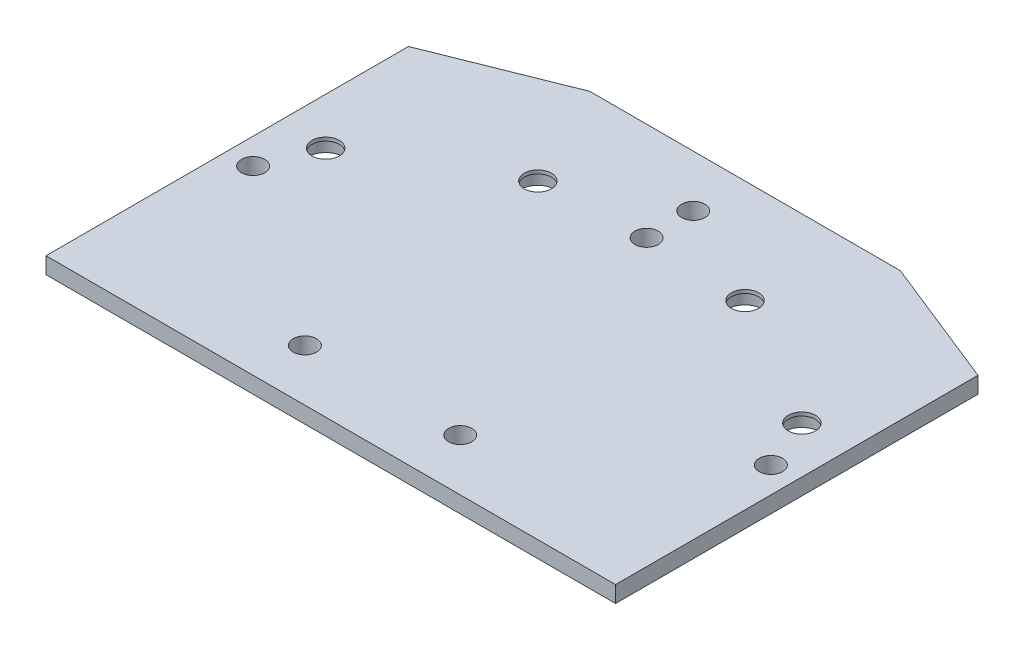
ISO-10303-21;
HEADER;
FILE_DESCRIPTION(('STEP AP214'),'2;1');
FILE_NAME('part.step','',(''),(''),'','','');
FILE_SCHEMA(('AUTOMOTIVE_DESIGN { 1 0 10303 214 1 1 1 1 }'));
ENDSEC;
DATA;
#1=APPLICATION_CONTEXT('core data for automotive mechanical design processes');
#2=APPLICATION_PROTOCOL_DEFINITION('international standard','automotive_design',2000,#1);
#3=PRODUCT_CONTEXT('',#1,'mechanical');
#4=PRODUCT('Part','Part','',(#3));
#5=PRODUCT_RELATED_PRODUCT_CATEGORY('part','',(#4));
#6=PRODUCT_DEFINITION_FORMATION('','',#4);
#7=PRODUCT_DEFINITION_CONTEXT('part definition',#1,'design');
#8=PRODUCT_DEFINITION('design','',#6,#7);
#9=PRODUCT_DEFINITION_SHAPE('','',#8);
#10=(LENGTH_UNIT() NAMED_UNIT(*) SI_UNIT(.MILLI.,.METRE.));
#11=(NAMED_UNIT(*) PLANE_ANGLE_UNIT() SI_UNIT($,.RADIAN.));
#12=(NAMED_UNIT(*) SI_UNIT($,.STERADIAN.) SOLID_ANGLE_UNIT());
#13=UNCERTAINTY_MEASURE_WITH_UNIT(LENGTH_MEASURE(1.E-05),#10,'distance_accuracy_value','');
#14=(GEOMETRIC_REPRESENTATION_CONTEXT(3) GLOBAL_UNCERTAINTY_ASSIGNED_CONTEXT((#13)) GLOBAL_UNIT_ASSIGNED_CONTEXT((#10,
#11,#12)) REPRESENTATION_CONTEXT('',''));
#15=CARTESIAN_POINT('',(0.,0.,0.));
#16=DIRECTION('',(0.,0.,1.));
#17=DIRECTION('',(1.,0.,0.));
#18=AXIS2_PLACEMENT_3D('',#15,#16,#17);
#19=CARTESIAN_POINT('',(-45.9807621135332,1.5875,9.99999999999996));
#20=DIRECTION('',(0.,1.,0.));
#21=DIRECTION('',(0.,0.,1.));
#22=AXIS2_PLACEMENT_3D('',#19,#20,#21);
#23=CYLINDRICAL_SURFACE('',#22,2.625);
#24=CARTESIAN_POINT('',(-45.9807621135332,1.5875,9.99999999999996));
#25=DIRECTION('',(0.,1.,0.));
#26=DIRECTION('',(0.,0.,1.));
#27=AXIS2_PLACEMENT_3D('',#24,#25,#26);
#28=CIRCLE('',#27,2.625);
#29=CARTESIAN_POINT('',(-45.9807621135332,1.5875,12.625));
#30=VERTEX_POINT('',#29);
#31=EDGE_CURVE('E147',#30,#30,#28,.T.);
#32=ORIENTED_EDGE('',*,*,#31,.T.);
#33=EDGE_LOOP('',(#32));
#34=FACE_BOUND('',#33,.T.);
#35=CARTESIAN_POINT('',(-45.9807621135332,0.9125,9.99999999999996));
#36=DIRECTION('',(0.,-1.,0.));
#37=DIRECTION('',(0.,0.,-1.));
#38=AXIS2_PLACEMENT_3D('',#35,#36,#37);
#39=CIRCLE('',#38,2.625);
#40=CARTESIAN_POINT('',(-45.9807621135332,0.9125,7.37499999999996));
#41=VERTEX_POINT('',#40);
#42=EDGE_CURVE('E54',#41,#41,#39,.F.);
#43=ORIENTED_EDGE('',*,*,#42,.F.);
#44=EDGE_LOOP('',(#43));
#45=FACE_BOUND('',#44,.T.);
#46=ADVANCED_FACE('F50',(#34,#45),#23,.F.);
#47=CARTESIAN_POINT('',(-20.,1.5875,-4.99999999999997));
#48=DIRECTION('',(0.,1.,0.));
#49=DIRECTION('',(0.,0.,1.));
#50=AXIS2_PLACEMENT_3D('',#47,#48,#49);
#51=CYLINDRICAL_SURFACE('',#50,2.625);
#52=CARTESIAN_POINT('',(-20.,1.5875,-4.99999999999997));
#53=DIRECTION('',(0.,1.,0.));
#54=DIRECTION('',(0.,0.,1.));
#55=AXIS2_PLACEMENT_3D('',#52,#53,#54);
#56=CIRCLE('',#55,2.625);
#57=CARTESIAN_POINT('',(-20.,1.5875,-2.37499999999997));
#58=VERTEX_POINT('',#57);
#59=EDGE_CURVE('E200',#58,#58,#56,.T.);
#60=ORIENTED_EDGE('',*,*,#59,.T.);
#61=EDGE_LOOP('',(#60));
#62=FACE_BOUND('',#61,.T.);
#63=CARTESIAN_POINT('',(-20.,0.9125,-4.99999999999997));
#64=DIRECTION('',(0.,-1.,0.));
#65=DIRECTION('',(0.,0.,-1.));
#66=AXIS2_PLACEMENT_3D('',#63,#64,#65);
#67=CIRCLE('',#66,2.625);
#68=CARTESIAN_POINT('',(-20.,0.9125,-7.62499999999997));
#69=VERTEX_POINT('',#68);
#70=EDGE_CURVE('E182',#69,#69,#67,.F.);
#71=ORIENTED_EDGE('',*,*,#70,.F.);
#72=EDGE_LOOP('',(#71));
#73=FACE_BOUND('',#72,.T.);
#74=ADVANCED_FACE('F230',(#62,#73),#51,.F.);
#75=CARTESIAN_POINT('',(45.9807621135332,1.5875,9.99999999999996));
#76=DIRECTION('',(0.,1.,0.));
#77=DIRECTION('',(0.,0.,1.));
#78=AXIS2_PLACEMENT_3D('',#75,#76,#77);
#79=CYLINDRICAL_SURFACE('',#78,2.625);
#80=CARTESIAN_POINT('',(45.9807621135332,1.5875,9.99999999999996));
#81=DIRECTION('',(0.,1.,0.));
#82=DIRECTION('',(0.,0.,1.));
#83=AXIS2_PLACEMENT_3D('',#80,#81,#82);
#84=CIRCLE('',#83,2.625);
#85=CARTESIAN_POINT('',(45.9807621135332,1.5875,12.625));
#86=VERTEX_POINT('',#85);
#87=EDGE_CURVE('E194',#86,#86,#84,.T.);
#88=ORIENTED_EDGE('',*,*,#87,.T.);
#89=EDGE_LOOP('',(#88));
#90=FACE_BOUND('',#89,.T.);
#91=CARTESIAN_POINT('',(45.9807621135332,0.9125,9.99999999999996));
#92=DIRECTION('',(0.,-1.,0.));
#93=DIRECTION('',(0.,0.,-1.));
#94=AXIS2_PLACEMENT_3D('',#91,#92,#93);
#95=CIRCLE('',#94,2.625);
#96=CARTESIAN_POINT('',(45.9807621135332,0.9125,7.37499999999996));
#97=VERTEX_POINT('',#96);
#98=EDGE_CURVE('E178',#97,#97,#95,.F.);
#99=ORIENTED_EDGE('',*,*,#98,.F.);
#100=EDGE_LOOP('',(#99));
#101=FACE_BOUND('',#100,.T.);
#102=ADVANCED_FACE('F236',(#90,#101),#79,.F.);
#103=CARTESIAN_POINT('',(20.,1.5875,-4.99999999999997));
#104=DIRECTION('',(0.,1.,0.));
#105=DIRECTION('',(0.,0.,1.));
#106=AXIS2_PLACEMENT_3D('',#103,#104,#105);
#107=CYLINDRICAL_SURFACE('',#106,2.625);
#108=CARTESIAN_POINT('',(20.,1.5875,-4.99999999999997));
#109=DIRECTION('',(0.,1.,0.));
#110=DIRECTION('',(0.,0.,1.));
#111=AXIS2_PLACEMENT_3D('',#108,#109,#110);
#112=CIRCLE('',#111,2.625);
#113=CARTESIAN_POINT('',(20.,1.5875,-2.37499999999997));
#114=VERTEX_POINT('',#113);
#115=EDGE_CURVE('E189',#114,#114,#112,.T.);
#116=ORIENTED_EDGE('',*,*,#115,.T.);
#117=EDGE_LOOP('',(#116));
#118=FACE_BOUND('',#117,.T.);
#119=CARTESIAN_POINT('',(20.,0.9125,-4.99999999999997));
#120=DIRECTION('',(0.,-1.,0.));
#121=DIRECTION('',(0.,0.,-1.));
#122=AXIS2_PLACEMENT_3D('',#119,#120,#121);
#123=CIRCLE('',#122,2.625);
#124=CARTESIAN_POINT('',(20.,0.9125,-7.62499999999997));
#125=VERTEX_POINT('',#124);
#126=EDGE_CURVE('E174',#125,#125,#123,.F.);
#127=ORIENTED_EDGE('',*,*,#126,.F.);
#128=EDGE_LOOP('',(#127));
#129=FACE_BOUND('',#128,.T.);
#130=ADVANCED_FACE('F227',(#118,#129),#107,.F.);
#131=CARTESIAN_POINT('',(-55.,1.5875,55.));
#132=DIRECTION('',(-1.,0.,0.));
#133=DIRECTION('',(0.,0.,1.));
#134=AXIS2_PLACEMENT_3D('',#131,#132,#133);
#135=PLANE('',#134);
#136=DIRECTION('',(0.,0.,-1.));
#137=VECTOR('',#136,1.);
#138=CARTESIAN_POINT('',(-55.,-1.5875,55.));
#139=LINE('',#138,#137);
#140=CARTESIAN_POINT('',(-55.,-1.5875,55.));
#141=VERTEX_POINT('',#140);
#142=CARTESIAN_POINT('',(-55.,-1.5875,-15.));
#143=VERTEX_POINT('',#142);
#144=EDGE_CURVE('E142',#141,#143,#139,.T.);
#145=ORIENTED_EDGE('',*,*,#144,.F.);
#146=DIRECTION('',(0.,-1.,0.));
#147=VECTOR('',#146,1.);
#148=CARTESIAN_POINT('',(-55.,1.5875,55.));
#149=LINE('',#148,#147);
#150=CARTESIAN_POINT('',(-55.,1.5875,55.));
#151=VERTEX_POINT('',#150);
#152=EDGE_CURVE('E11',#151,#141,#149,.T.);
#153=ORIENTED_EDGE('',*,*,#152,.F.);
#154=DIRECTION('',(0.,0.,-1.));
#155=VECTOR('',#154,1.);
#156=CARTESIAN_POINT('',(-55.,1.5875,55.));
#157=LINE('',#156,#155);
#158=CARTESIAN_POINT('',(-55.,1.5875,-15.));
#159=VERTEX_POINT('',#158);
#160=EDGE_CURVE('E163',#151,#159,#157,.T.);
#161=ORIENTED_EDGE('',*,*,#160,.T.);
#162=DIRECTION('',(0.,-1.,0.));
#163=VECTOR('',#162,1.);
#164=CARTESIAN_POINT('',(-55.,1.5875,-15.));
#165=LINE('',#164,#163);
#166=EDGE_CURVE('E102',#159,#143,#165,.T.);
#167=ORIENTED_EDGE('',*,*,#166,.T.);
#168=EDGE_LOOP('',(#145,#153,#161,#167));
#169=FACE_BOUND('',#168,.T.);
#170=ADVANCED_FACE('F52',(#169),#135,.T.);
#171=CARTESIAN_POINT('',(55.,1.5875,55.));
#172=DIRECTION('',(0.,0.,1.));
#173=DIRECTION('',(1.,0.,0.));
#174=AXIS2_PLACEMENT_3D('',#171,#172,#173);
#175=PLANE('',#174);
#176=DIRECTION('',(-1.,0.,0.));
#177=VECTOR('',#176,1.);
#178=CARTESIAN_POINT('',(55.,-1.5875,55.));
#179=LINE('',#178,#177);
#180=CARTESIAN_POINT('',(55.,-1.5875,55.));
#181=VERTEX_POINT('',#180);
#182=EDGE_CURVE('E160',#181,#141,#179,.T.);
#183=ORIENTED_EDGE('',*,*,#182,.F.);
#184=DIRECTION('',(0.,-1.,0.));
#185=VECTOR('',#184,1.);
#186=CARTESIAN_POINT('',(55.,1.5875,55.));
#187=LINE('',#186,#185);
#188=CARTESIAN_POINT('',(55.,1.5875,55.));
#189=VERTEX_POINT('',#188);
#190=EDGE_CURVE('E61',#189,#181,#187,.T.);
#191=ORIENTED_EDGE('',*,*,#190,.F.);
#192=DIRECTION('',(-1.,0.,0.));
#193=VECTOR('',#192,1.);
#194=CARTESIAN_POINT('',(55.,1.5875,55.));
#195=LINE('',#194,#193);
#196=EDGE_CURVE('E118',#189,#151,#195,.T.);
#197=ORIENTED_EDGE('',*,*,#196,.T.);
#198=ORIENTED_EDGE('',*,*,#152,.T.);
#199=EDGE_LOOP('',(#183,#191,#197,#198));
#200=FACE_BOUND('',#199,.T.);
#201=ADVANCED_FACE('F219',(#200),#175,.T.);
#202=CARTESIAN_POINT('',(55.,1.5875,55.));
#203=DIRECTION('',(-1.,0.,0.));
#204=DIRECTION('',(0.,0.,1.));
#205=AXIS2_PLACEMENT_3D('',#202,#203,#204);
#206=PLANE('',#205);
#207=DIRECTION('',(0.,0.,-1.));
#208=VECTOR('',#207,1.);
#209=CARTESIAN_POINT('',(55.,-1.5875,55.));
#210=LINE('',#209,#208);
#211=CARTESIAN_POINT('',(55.,-1.5875,-15.));
#212=VERTEX_POINT('',#211);
#213=EDGE_CURVE('E123',#181,#212,#210,.T.);
#214=ORIENTED_EDGE('',*,*,#213,.T.);
#215=DIRECTION('',(0.,-1.,0.));
#216=VECTOR('',#215,1.);
#217=CARTESIAN_POINT('',(55.,1.5875,-15.));
#218=LINE('',#217,#216);
#219=CARTESIAN_POINT('',(55.,1.5875,-15.));
#220=VERTEX_POINT('',#219);
#221=EDGE_CURVE('E121',#220,#212,#218,.T.);
#222=ORIENTED_EDGE('',*,*,#221,.F.);
#223=DIRECTION('',(0.,0.,-1.));
#224=VECTOR('',#223,1.);
#225=CARTESIAN_POINT('',(55.,1.5875,55.));
#226=LINE('',#225,#224);
#227=EDGE_CURVE('E113',#189,#220,#226,.T.);
#228=ORIENTED_EDGE('',*,*,#227,.F.);
#229=ORIENTED_EDGE('',*,*,#190,.T.);
#230=EDGE_LOOP('',(#214,#222,#228,#229));
#231=FACE_BOUND('',#230,.T.);
#232=ADVANCED_FACE('F122',(#231),#206,.F.);
#233=CARTESIAN_POINT('',(30.,1.5875,-25.));
#234=DIRECTION('',(0.371390676354104,0.,-0.928476690885259));
#235=DIRECTION('',(-0.928476690885259,0.,-0.371390676354104));
#236=AXIS2_PLACEMENT_3D('',#233,#234,#235);
#237=PLANE('',#236);
#238=DIRECTION('',(0.928476690885259,0.,0.371390676354104));
#239=VECTOR('',#238,1.);
#240=CARTESIAN_POINT('',(30.,-1.5875,-25.));
#241=LINE('',#240,#239);
#242=CARTESIAN_POINT('',(30.,-1.5875,-25.));
#243=VERTEX_POINT('',#242);
#244=EDGE_CURVE('E155',#243,#212,#241,.T.);
#245=ORIENTED_EDGE('',*,*,#244,.F.);
#246=DIRECTION('',(0.,-1.,0.));
#247=VECTOR('',#246,1.);
#248=CARTESIAN_POINT('',(30.,1.5875,-25.));
#249=LINE('',#248,#247);
#250=CARTESIAN_POINT('',(30.,1.5875,-25.));
#251=VERTEX_POINT('',#250);
#252=EDGE_CURVE('E128',#251,#243,#249,.T.);
#253=ORIENTED_EDGE('',*,*,#252,.F.);
#254=DIRECTION('',(0.928476690885259,0.,0.371390676354104));
#255=VECTOR('',#254,1.);
#256=CARTESIAN_POINT('',(30.,1.5875,-25.));
#257=LINE('',#256,#255);
#258=EDGE_CURVE('E117',#251,#220,#257,.T.);
#259=ORIENTED_EDGE('',*,*,#258,.T.);
#260=ORIENTED_EDGE('',*,*,#221,.T.);
#261=EDGE_LOOP('',(#245,#253,#259,#260));
#262=FACE_BOUND('',#261,.T.);
#263=ADVANCED_FACE('F130',(#262),#237,.T.);
#264=CARTESIAN_POINT('',(30.,1.5875,-25.));
#265=DIRECTION('',(0.,0.,1.));
#266=DIRECTION('',(1.,0.,0.));
#267=AXIS2_PLACEMENT_3D('',#264,#265,#266);
#268=PLANE('',#267);
#269=DIRECTION('',(-1.,0.,0.));
#270=VECTOR('',#269,1.);
#271=CARTESIAN_POINT('',(30.,-1.5875,-25.));
#272=LINE('',#271,#270);
#273=CARTESIAN_POINT('',(-30.,-1.5875,-25.));
#274=VERTEX_POINT('',#273);
#275=EDGE_CURVE('E151',#243,#274,#272,.T.);
#276=ORIENTED_EDGE('',*,*,#275,.T.);
#277=DIRECTION('',(0.,-1.,0.));
#278=VECTOR('',#277,1.);
#279=CARTESIAN_POINT('',(-30.,1.5875,-25.));
#280=LINE('',#279,#278);
#281=CARTESIAN_POINT('',(-30.,1.5875,-25.));
#282=VERTEX_POINT('',#281);
#283=EDGE_CURVE('E169',#282,#274,#280,.T.);
#284=ORIENTED_EDGE('',*,*,#283,.F.);
#285=DIRECTION('',(-1.,0.,0.));
#286=VECTOR('',#285,1.);
#287=CARTESIAN_POINT('',(30.,1.5875,-25.));
#288=LINE('',#287,#286);
#289=EDGE_CURVE('E133',#251,#282,#288,.T.);
#290=ORIENTED_EDGE('',*,*,#289,.F.);
#291=ORIENTED_EDGE('',*,*,#252,.T.);
#292=EDGE_LOOP('',(#276,#284,#290,#291));
#293=FACE_BOUND('',#292,.T.);
#294=ADVANCED_FACE('F578',(#293),#268,.F.);
#295=CARTESIAN_POINT('',(-55.,1.5875,-15.));
#296=DIRECTION('',(-0.371390676354103,0.,-0.92847669088526));
#297=DIRECTION('',(-0.92847669088526,0.,0.371390676354103));
#298=AXIS2_PLACEMENT_3D('',#295,#296,#297);
#299=PLANE('',#298);
#300=DIRECTION('',(0.92847669088526,0.,-0.371390676354103));
#301=VECTOR('',#300,1.);
#302=CARTESIAN_POINT('',(-55.,-1.5875,-15.));
#303=LINE('',#302,#301);
#304=EDGE_CURVE('E146',#143,#274,#303,.T.);
#305=ORIENTED_EDGE('',*,*,#304,.F.);
#306=ORIENTED_EDGE('',*,*,#166,.F.);
#307=DIRECTION('',(0.92847669088526,0.,-0.371390676354103));
#308=VECTOR('',#307,1.);
#309=CARTESIAN_POINT('',(-55.,1.5875,-15.));
#310=LINE('',#309,#308);
#311=EDGE_CURVE('E136',#159,#282,#310,.T.);
#312=ORIENTED_EDGE('',*,*,#311,.T.);
#313=ORIENTED_EDGE('',*,*,#283,.T.);
#314=EDGE_LOOP('',(#305,#306,#312,#313));
#315=FACE_BOUND('',#314,.T.);
#316=ADVANCED_FACE('F214',(#315),#299,.T.);
#317=CARTESIAN_POINT('',(0.,1.5875,0.));
#318=DIRECTION('',(0.,1.,0.));
#319=DIRECTION('',(0.,0.,1.));
#320=AXIS2_PLACEMENT_3D('',#317,#318,#319);
#321=PLANE('',#320);
#322=CARTESIAN_POINT('',(-50.,1.5875,20.));
#323=DIRECTION('',(0.,1.,0.));
#324=DIRECTION('',(0.,0.,1.));
#325=AXIS2_PLACEMENT_3D('',#322,#323,#324);
#326=CIRCLE('',#325,2.24999999999999);
#327=CARTESIAN_POINT('',(-50.,1.5875,22.25));
#328=VERTEX_POINT('',#327);
#329=EDGE_CURVE('E347',#328,#328,#326,.T.);
#330=ORIENTED_EDGE('',*,*,#329,.F.);
#331=EDGE_LOOP('',(#330));
#332=FACE_BOUND('',#331,.T.);
#333=CARTESIAN_POINT('',(50.,1.5875,20.));
#334=DIRECTION('',(0.,1.,0.));
#335=DIRECTION('',(0.,0.,1.));
#336=AXIS2_PLACEMENT_3D('',#333,#334,#335);
#337=CIRCLE('',#336,2.24999999999999);
#338=CARTESIAN_POINT('',(50.,1.5875,22.25));
#339=VERTEX_POINT('',#338);
#340=EDGE_CURVE('E341',#339,#339,#337,.T.);
#341=ORIENTED_EDGE('',*,*,#340,.F.);
#342=EDGE_LOOP('',(#341));
#343=FACE_BOUND('',#342,.T.);
#344=CARTESIAN_POINT('',(-15.,1.5875,45.));
#345=DIRECTION('',(0.,1.,0.));
#346=DIRECTION('',(0.,0.,1.));
#347=AXIS2_PLACEMENT_3D('',#344,#345,#346);
#348=CIRCLE('',#347,2.24999999999999);
#349=CARTESIAN_POINT('',(-15.,1.5875,47.25));
#350=VERTEX_POINT('',#349);
#351=EDGE_CURVE('E335',#350,#350,#348,.T.);
#352=ORIENTED_EDGE('',*,*,#351,.F.);
#353=EDGE_LOOP('',(#352));
#354=FACE_BOUND('',#353,.T.);
#355=CARTESIAN_POINT('',(15.,1.5875,45.));
#356=DIRECTION('',(0.,1.,0.));
#357=DIRECTION('',(0.,0.,1.));
#358=AXIS2_PLACEMENT_3D('',#355,#356,#357);
#359=CIRCLE('',#358,2.24999999999999);
#360=CARTESIAN_POINT('',(15.,1.5875,47.25));
#361=VERTEX_POINT('',#360);
#362=EDGE_CURVE('E329',#361,#361,#359,.T.);
#363=ORIENTED_EDGE('',*,*,#362,.F.);
#364=EDGE_LOOP('',(#363));
#365=FACE_BOUND('',#364,.T.);
#366=CARTESIAN_POINT('',(0.,1.5875,-15.));
#367=DIRECTION('',(0.,-1.,0.));
#368=DIRECTION('',(0.,0.,-1.));
#369=AXIS2_PLACEMENT_3D('',#366,#367,#368);
#370=CIRCLE('',#369,2.25);
#371=CARTESIAN_POINT('',(0.,1.5875,-17.25));
#372=VERTEX_POINT('',#371);
#373=EDGE_CURVE('E321',#372,#372,#370,.T.);
#374=ORIENTED_EDGE('',*,*,#373,.T.);
#375=EDGE_LOOP('',(#374));
#376=FACE_BOUND('',#375,.T.);
#377=CARTESIAN_POINT('',(0.,1.5875,-5.99999999999998));
#378=DIRECTION('',(0.,-1.,0.));
#379=DIRECTION('',(0.,0.,-1.));
#380=AXIS2_PLACEMENT_3D('',#377,#378,#379);
#381=CIRCLE('',#380,2.25);
#382=CARTESIAN_POINT('',(0.,1.5875,-8.24999999999998));
#383=VERTEX_POINT('',#382);
#384=EDGE_CURVE('E301',#383,#383,#381,.T.);
#385=ORIENTED_EDGE('',*,*,#384,.T.);
#386=EDGE_LOOP('',(#385));
#387=FACE_BOUND('',#386,.T.);
#388=ORIENTED_EDGE('',*,*,#115,.F.);
#389=EDGE_LOOP('',(#388));
#390=FACE_BOUND('',#389,.T.);
#391=ORIENTED_EDGE('',*,*,#87,.F.);
#392=EDGE_LOOP('',(#391));
#393=FACE_BOUND('',#392,.T.);
#394=ORIENTED_EDGE('',*,*,#59,.F.);
#395=EDGE_LOOP('',(#394));
#396=FACE_BOUND('',#395,.T.);
#397=ORIENTED_EDGE('',*,*,#31,.F.);
#398=EDGE_LOOP('',(#397));
#399=FACE_BOUND('',#398,.T.);
#400=ORIENTED_EDGE('',*,*,#160,.F.);
#401=ORIENTED_EDGE('',*,*,#196,.F.);
#402=ORIENTED_EDGE('',*,*,#227,.T.);
#403=ORIENTED_EDGE('',*,*,#258,.F.);
#404=ORIENTED_EDGE('',*,*,#289,.T.);
#405=ORIENTED_EDGE('',*,*,#311,.F.);
#406=EDGE_LOOP('',(#400,#401,#402,#403,#404,#405));
#407=FACE_BOUND('',#406,.T.);
#408=ADVANCED_FACE('F115',(#332,#343,#354,#365,#376,#387,#390,#393,#396,#399,#407),#321,.T.);
#409=CARTESIAN_POINT('',(0.,-1.5875,0.));
#410=DIRECTION('',(0.,1.,0.));
#411=DIRECTION('',(0.,0.,1.));
#412=AXIS2_PLACEMENT_3D('',#409,#410,#411);
#413=PLANE('',#412);
#414=CARTESIAN_POINT('',(-50.,-1.5875,20.));
#415=DIRECTION('',(0.,1.,0.));
#416=DIRECTION('',(0.,0.,1.));
#417=AXIS2_PLACEMENT_3D('',#414,#415,#416);
#418=CIRCLE('',#417,2.24999999999999);
#419=CARTESIAN_POINT('',(-50.,-1.5875,22.25));
#420=VERTEX_POINT('',#419);
#421=EDGE_CURVE('E257',#420,#420,#418,.T.);
#422=ORIENTED_EDGE('',*,*,#421,.T.);
#423=EDGE_LOOP('',(#422));
#424=FACE_BOUND('',#423,.T.);
#425=CARTESIAN_POINT('',(50.,-1.5875,20.));
#426=DIRECTION('',(0.,1.,0.));
#427=DIRECTION('',(0.,0.,1.));
#428=AXIS2_PLACEMENT_3D('',#425,#426,#427);
#429=CIRCLE('',#428,2.24999999999999);
#430=CARTESIAN_POINT('',(50.,-1.5875,22.25));
#431=VERTEX_POINT('',#430);
#432=EDGE_CURVE('E261',#431,#431,#429,.T.);
#433=ORIENTED_EDGE('',*,*,#432,.T.);
#434=EDGE_LOOP('',(#433));
#435=FACE_BOUND('',#434,.T.);
#436=CARTESIAN_POINT('',(-15.,-1.5875,45.));
#437=DIRECTION('',(0.,1.,0.));
#438=DIRECTION('',(0.,0.,1.));
#439=AXIS2_PLACEMENT_3D('',#436,#437,#438);
#440=CIRCLE('',#439,2.25);
#441=CARTESIAN_POINT('',(-15.,-1.5875,47.25));
#442=VERTEX_POINT('',#441);
#443=EDGE_CURVE('E265',#442,#442,#440,.T.);
#444=ORIENTED_EDGE('',*,*,#443,.T.);
#445=EDGE_LOOP('',(#444));
#446=FACE_BOUND('',#445,.T.);
#447=CARTESIAN_POINT('',(15.,-1.5875,45.));
#448=DIRECTION('',(0.,1.,0.));
#449=DIRECTION('',(0.,0.,1.));
#450=AXIS2_PLACEMENT_3D('',#447,#448,#449);
#451=CIRCLE('',#450,2.25);
#452=CARTESIAN_POINT('',(15.,-1.5875,47.25));
#453=VERTEX_POINT('',#452);
#454=EDGE_CURVE('E269',#453,#453,#451,.T.);
#455=ORIENTED_EDGE('',*,*,#454,.T.);
#456=EDGE_LOOP('',(#455));
#457=FACE_BOUND('',#456,.T.);
#458=CARTESIAN_POINT('',(0.,-1.5875,-15.));
#459=DIRECTION('',(0.,-1.,0.));
#460=DIRECTION('',(0.,0.,-1.));
#461=AXIS2_PLACEMENT_3D('',#458,#459,#460);
#462=CIRCLE('',#461,2.25);
#463=CARTESIAN_POINT('',(0.,-1.5875,-17.25));
#464=VERTEX_POINT('',#463);
#465=EDGE_CURVE('E273',#464,#464,#462,.T.);
#466=ORIENTED_EDGE('',*,*,#465,.F.);
#467=EDGE_LOOP('',(#466));
#468=FACE_BOUND('',#467,.T.);
#469=CARTESIAN_POINT('',(0.,-1.5875,-5.99999999999998));
#470=DIRECTION('',(0.,-1.,0.));
#471=DIRECTION('',(0.,0.,-1.));
#472=AXIS2_PLACEMENT_3D('',#469,#470,#471);
#473=CIRCLE('',#472,2.25);
#474=CARTESIAN_POINT('',(0.,-1.5875,-8.24999999999998));
#475=VERTEX_POINT('',#474);
#476=EDGE_CURVE('E277',#475,#475,#473,.T.);
#477=ORIENTED_EDGE('',*,*,#476,.F.);
#478=EDGE_LOOP('',(#477));
#479=FACE_BOUND('',#478,.T.);
#480=CARTESIAN_POINT('',(-45.9807621135332,-1.5875,9.99999999999996));
#481=DIRECTION('',(0.,-1.,0.));
#482=DIRECTION('',(0.,0.,-1.));
#483=AXIS2_PLACEMENT_3D('',#480,#481,#482);
#484=CIRCLE('',#483,3.45);
#485=CARTESIAN_POINT('',(-45.9807621135332,-1.5875,6.54999999999996));
#486=VERTEX_POINT('',#485);
#487=EDGE_CURVE('E281',#486,#486,#484,.T.);
#488=ORIENTED_EDGE('',*,*,#487,.F.);
#489=EDGE_LOOP('',(#488));
#490=FACE_BOUND('',#489,.T.);
#491=CARTESIAN_POINT('',(-20.,-1.5875,-4.99999999999997));
#492=DIRECTION('',(0.,-1.,0.));
#493=DIRECTION('',(0.,0.,-1.));
#494=AXIS2_PLACEMENT_3D('',#491,#492,#493);
#495=CIRCLE('',#494,3.45);
#496=CARTESIAN_POINT('',(-20.,-1.5875,-8.44999999999998));
#497=VERTEX_POINT('',#496);
#498=EDGE_CURVE('E285',#497,#497,#495,.T.);
#499=ORIENTED_EDGE('',*,*,#498,.F.);
#500=EDGE_LOOP('',(#499));
#501=FACE_BOUND('',#500,.T.);
#502=CARTESIAN_POINT('',(20.,-1.5875,-4.99999999999997));
#503=DIRECTION('',(0.,-1.,0.));
#504=DIRECTION('',(0.,0.,-1.));
#505=AXIS2_PLACEMENT_3D('',#502,#503,#504);
#506=CIRCLE('',#505,3.45);
#507=CARTESIAN_POINT('',(20.,-1.5875,-8.44999999999997));
#508=VERTEX_POINT('',#507);
#509=EDGE_CURVE('E289',#508,#508,#506,.T.);
#510=ORIENTED_EDGE('',*,*,#509,.F.);
#511=EDGE_LOOP('',(#510));
#512=FACE_BOUND('',#511,.T.);
#513=CARTESIAN_POINT('',(45.9807621135332,-1.5875,9.99999999999996));
#514=DIRECTION('',(0.,-1.,0.));
#515=DIRECTION('',(0.,0.,-1.));
#516=AXIS2_PLACEMENT_3D('',#513,#514,#515);
#517=CIRCLE('',#516,3.45);
#518=CARTESIAN_POINT('',(45.9807621135332,-1.5875,6.54999999999996));
#519=VERTEX_POINT('',#518);
#520=EDGE_CURVE('E292',#519,#519,#517,.T.);
#521=ORIENTED_EDGE('',*,*,#520,.F.);
#522=EDGE_LOOP('',(#521));
#523=FACE_BOUND('',#522,.T.);
#524=ORIENTED_EDGE('',*,*,#144,.T.);
#525=ORIENTED_EDGE('',*,*,#304,.T.);
#526=ORIENTED_EDGE('',*,*,#275,.F.);
#527=ORIENTED_EDGE('',*,*,#244,.T.);
#528=ORIENTED_EDGE('',*,*,#213,.F.);
#529=ORIENTED_EDGE('',*,*,#182,.T.);
#530=EDGE_LOOP('',(#524,#525,#526,#527,#528,#529));
#531=FACE_BOUND('',#530,.T.);
#532=ADVANCED_FACE('F218',(#424,#435,#446,#457,#468,#479,#490,#501,#512,#523,#531),#413,.F.);
#533=CARTESIAN_POINT('',(20.,0.9125,-4.99999999999997));
#534=DIRECTION('',(0.,-1.,0.));
#535=DIRECTION('',(0.,0.,-1.));
#536=AXIS2_PLACEMENT_3D('',#533,#534,#535);
#537=PLANE('',#536);
#538=CARTESIAN_POINT('',(20.,0.9125,-4.99999999999997));
#539=DIRECTION('',(0.,-1.,0.));
#540=DIRECTION('',(0.,0.,-1.));
#541=AXIS2_PLACEMENT_3D('',#538,#539,#540);
#542=CIRCLE('',#541,3.45);
#543=CARTESIAN_POINT('',(20.,0.9125,-8.44999999999997));
#544=VERTEX_POINT('',#543);
#545=EDGE_CURVE('E295',#544,#544,#542,.T.);
#546=ORIENTED_EDGE('',*,*,#545,.T.);
#547=EDGE_LOOP('',(#546));
#548=FACE_BOUND('',#547,.T.);
#549=ORIENTED_EDGE('',*,*,#126,.T.);
#550=EDGE_LOOP('',(#549));
#551=FACE_BOUND('',#550,.T.);
#552=ADVANCED_FACE('F245',(#548,#551),#537,.T.);
#553=CARTESIAN_POINT('',(20.,0.9125,-4.99999999999997));
#554=DIRECTION('',(0.,-1.,0.));
#555=DIRECTION('',(0.,0.,-1.));
#556=AXIS2_PLACEMENT_3D('',#553,#554,#555);
#557=CYLINDRICAL_SURFACE('',#556,3.45);
#558=ORIENTED_EDGE('',*,*,#545,.F.);
#559=EDGE_LOOP('',(#558));
#560=FACE_BOUND('',#559,.T.);
#561=ORIENTED_EDGE('',*,*,#509,.T.);
#562=EDGE_LOOP('',(#561));
#563=FACE_BOUND('',#562,.T.);
#564=ADVANCED_FACE('F251',(#560,#563),#557,.F.);
#565=CARTESIAN_POINT('',(45.9807621135332,0.9125,9.99999999999996));
#566=DIRECTION('',(0.,-1.,0.));
#567=DIRECTION('',(0.,0.,-1.));
#568=AXIS2_PLACEMENT_3D('',#565,#566,#567);
#569=PLANE('',#568);
#570=CARTESIAN_POINT('',(45.9807621135332,0.9125,9.99999999999996));
#571=DIRECTION('',(0.,-1.,0.));
#572=DIRECTION('',(0.,0.,-1.));
#573=AXIS2_PLACEMENT_3D('',#570,#571,#572);
#574=CIRCLE('',#573,3.45);
#575=CARTESIAN_POINT('',(45.9807621135332,0.9125,6.54999999999996));
#576=VERTEX_POINT('',#575);
#577=EDGE_CURVE('E203',#576,#576,#574,.T.);
#578=ORIENTED_EDGE('',*,*,#577,.T.);
#579=EDGE_LOOP('',(#578));
#580=FACE_BOUND('',#579,.T.);
#581=ORIENTED_EDGE('',*,*,#98,.T.);
#582=EDGE_LOOP('',(#581));
#583=FACE_BOUND('',#582,.T.);
#584=ADVANCED_FACE('F376',(#580,#583),#569,.T.);
#585=CARTESIAN_POINT('',(45.9807621135332,0.9125,9.99999999999996));
#586=DIRECTION('',(0.,-1.,0.));
#587=DIRECTION('',(0.,0.,-1.));
#588=AXIS2_PLACEMENT_3D('',#585,#586,#587);
#589=CYLINDRICAL_SURFACE('',#588,3.45);
#590=ORIENTED_EDGE('',*,*,#577,.F.);
#591=EDGE_LOOP('',(#590));
#592=FACE_BOUND('',#591,.T.);
#593=ORIENTED_EDGE('',*,*,#520,.T.);
#594=EDGE_LOOP('',(#593));
#595=FACE_BOUND('',#594,.T.);
#596=ADVANCED_FACE('F378',(#592,#595),#589,.F.);
#597=CARTESIAN_POINT('',(-20.,0.9125,-4.99999999999997));
#598=DIRECTION('',(0.,-1.,0.));
#599=DIRECTION('',(0.,0.,-1.));
#600=AXIS2_PLACEMENT_3D('',#597,#598,#599);
#601=PLANE('',#600);
#602=CARTESIAN_POINT('',(-20.,0.9125,-4.99999999999997));
#603=DIRECTION('',(0.,-1.,0.));
#604=DIRECTION('',(0.,0.,-1.));
#605=AXIS2_PLACEMENT_3D('',#602,#603,#604);
#606=CIRCLE('',#605,3.45);
#607=CARTESIAN_POINT('',(-20.,0.9125,-8.44999999999998));
#608=VERTEX_POINT('',#607);
#609=EDGE_CURVE('E305',#608,#608,#606,.T.);
#610=ORIENTED_EDGE('',*,*,#609,.T.);
#611=EDGE_LOOP('',(#610));
#612=FACE_BOUND('',#611,.T.);
#613=ORIENTED_EDGE('',*,*,#70,.T.);
#614=EDGE_LOOP('',(#613));
#615=FACE_BOUND('',#614,.T.);
#616=ADVANCED_FACE('F385',(#612,#615),#601,.T.);
#617=CARTESIAN_POINT('',(-20.,0.9125,-4.99999999999997));
#618=DIRECTION('',(0.,-1.,0.));
#619=DIRECTION('',(0.,0.,-1.));
#620=AXIS2_PLACEMENT_3D('',#617,#618,#619);
#621=CYLINDRICAL_SURFACE('',#620,3.45);
#622=ORIENTED_EDGE('',*,*,#609,.F.);
#623=EDGE_LOOP('',(#622));
#624=FACE_BOUND('',#623,.T.);
#625=ORIENTED_EDGE('',*,*,#498,.T.);
#626=EDGE_LOOP('',(#625));
#627=FACE_BOUND('',#626,.T.);
#628=ADVANCED_FACE('F465',(#624,#627),#621,.F.);
#629=CARTESIAN_POINT('',(-45.9807621135332,0.9125,9.99999999999996));
#630=DIRECTION('',(0.,-1.,0.));
#631=DIRECTION('',(0.,0.,-1.));
#632=AXIS2_PLACEMENT_3D('',#629,#630,#631);
#633=PLANE('',#632);
#634=CARTESIAN_POINT('',(-45.9807621135332,0.9125,9.99999999999996));
#635=DIRECTION('',(0.,-1.,0.));
#636=DIRECTION('',(0.,0.,-1.));
#637=AXIS2_PLACEMENT_3D('',#634,#635,#636);
#638=CIRCLE('',#637,3.45);
#639=CARTESIAN_POINT('',(-45.9807621135332,0.9125,6.54999999999996));
#640=VERTEX_POINT('',#639);
#641=EDGE_CURVE('E179',#640,#640,#638,.T.);
#642=ORIENTED_EDGE('',*,*,#641,.T.);
#643=EDGE_LOOP('',(#642));
#644=FACE_BOUND('',#643,.T.);
#645=ORIENTED_EDGE('',*,*,#42,.T.);
#646=EDGE_LOOP('',(#645));
#647=FACE_BOUND('',#646,.T.);
#648=ADVANCED_FACE('F475',(#644,#647),#633,.T.);
#649=CARTESIAN_POINT('',(-45.9807621135332,0.9125,9.99999999999996));
#650=DIRECTION('',(0.,-1.,0.));
#651=DIRECTION('',(0.,0.,-1.));
#652=AXIS2_PLACEMENT_3D('',#649,#650,#651);
#653=CYLINDRICAL_SURFACE('',#652,3.45);
#654=ORIENTED_EDGE('',*,*,#641,.F.);
#655=EDGE_LOOP('',(#654));
#656=FACE_BOUND('',#655,.T.);
#657=ORIENTED_EDGE('',*,*,#487,.T.);
#658=EDGE_LOOP('',(#657));
#659=FACE_BOUND('',#658,.T.);
#660=ADVANCED_FACE('F485',(#656,#659),#653,.F.);
#661=CARTESIAN_POINT('',(0.,-1.5875,-5.99999999999998));
#662=DIRECTION('',(0.,-1.,0.));
#663=DIRECTION('',(0.,0.,-1.));
#664=AXIS2_PLACEMENT_3D('',#661,#662,#663);
#665=CYLINDRICAL_SURFACE('',#664,2.25);
#666=ORIENTED_EDGE('',*,*,#384,.F.);
#667=EDGE_LOOP('',(#666));
#668=FACE_BOUND('',#667,.T.);
#669=ORIENTED_EDGE('',*,*,#476,.T.);
#670=EDGE_LOOP('',(#669));
#671=FACE_BOUND('',#670,.T.);
#672=ADVANCED_FACE('F495',(#668,#671),#665,.F.);
#673=CARTESIAN_POINT('',(0.,-1.5875,-15.));
#674=DIRECTION('',(0.,-1.,0.));
#675=DIRECTION('',(0.,0.,-1.));
#676=AXIS2_PLACEMENT_3D('',#673,#674,#675);
#677=CYLINDRICAL_SURFACE('',#676,2.25);
#678=ORIENTED_EDGE('',*,*,#373,.F.);
#679=EDGE_LOOP('',(#678));
#680=FACE_BOUND('',#679,.T.);
#681=ORIENTED_EDGE('',*,*,#465,.T.);
#682=EDGE_LOOP('',(#681));
#683=FACE_BOUND('',#682,.T.);
#684=ADVANCED_FACE('F505',(#680,#683),#677,.F.);
#685=CARTESIAN_POINT('',(15.,1.5875,45.));
#686=DIRECTION('',(0.,1.,0.));
#687=DIRECTION('',(0.,0.,1.));
#688=AXIS2_PLACEMENT_3D('',#685,#686,#687);
#689=CYLINDRICAL_SURFACE('',#688,2.24999999999999);
#690=ORIENTED_EDGE('',*,*,#454,.F.);
#691=EDGE_LOOP('',(#690));
#692=FACE_BOUND('',#691,.T.);
#693=ORIENTED_EDGE('',*,*,#362,.T.);
#694=EDGE_LOOP('',(#693));
#695=FACE_BOUND('',#694,.T.);
#696=ADVANCED_FACE('F515',(#692,#695),#689,.F.);
#697=CARTESIAN_POINT('',(-15.,1.5875,45.));
#698=DIRECTION('',(0.,1.,0.));
#699=DIRECTION('',(0.,0.,1.));
#700=AXIS2_PLACEMENT_3D('',#697,#698,#699);
#701=CYLINDRICAL_SURFACE('',#700,2.24999999999999);
#702=ORIENTED_EDGE('',*,*,#443,.F.);
#703=EDGE_LOOP('',(#702));
#704=FACE_BOUND('',#703,.T.);
#705=ORIENTED_EDGE('',*,*,#351,.T.);
#706=EDGE_LOOP('',(#705));
#707=FACE_BOUND('',#706,.T.);
#708=ADVANCED_FACE('F525',(#704,#707),#701,.F.);
#709=CARTESIAN_POINT('',(50.,1.5875,20.));
#710=DIRECTION('',(0.,1.,0.));
#711=DIRECTION('',(0.,0.,1.));
#712=AXIS2_PLACEMENT_3D('',#709,#710,#711);
#713=CYLINDRICAL_SURFACE('',#712,2.24999999999999);
#714=ORIENTED_EDGE('',*,*,#432,.F.);
#715=EDGE_LOOP('',(#714));
#716=FACE_BOUND('',#715,.T.);
#717=ORIENTED_EDGE('',*,*,#340,.T.);
#718=EDGE_LOOP('',(#717));
#719=FACE_BOUND('',#718,.T.);
#720=ADVANCED_FACE('F535',(#716,#719),#713,.F.);
#721=CARTESIAN_POINT('',(-50.,1.5875,20.));
#722=DIRECTION('',(0.,1.,0.));
#723=DIRECTION('',(0.,0.,1.));
#724=AXIS2_PLACEMENT_3D('',#721,#722,#723);
#725=CYLINDRICAL_SURFACE('',#724,2.24999999999999);
#726=ORIENTED_EDGE('',*,*,#421,.F.);
#727=EDGE_LOOP('',(#726));
#728=FACE_BOUND('',#727,.T.);
#729=ORIENTED_EDGE('',*,*,#329,.T.);
#730=EDGE_LOOP('',(#729));
#731=FACE_BOUND('',#730,.T.);
#732=ADVANCED_FACE('F352',(#728,#731),#725,.F.);
#733=CLOSED_SHELL('',(#46,#74,#102,#130,#170,#201,#232,#263,#294,#316,#408,#532,#552,#564,#584,
#596,#616,#628,#648,#660,#672,#684,#696,#708,#720,#732));
#734=MANIFOLD_SOLID_BREP('B2',#733);
#735=ADVANCED_BREP_SHAPE_REPRESENTATION('',(#18,#734),#14);
#736=SHAPE_DEFINITION_REPRESENTATION(#9,#735);
ENDSEC;
END-ISO-10303-21;
